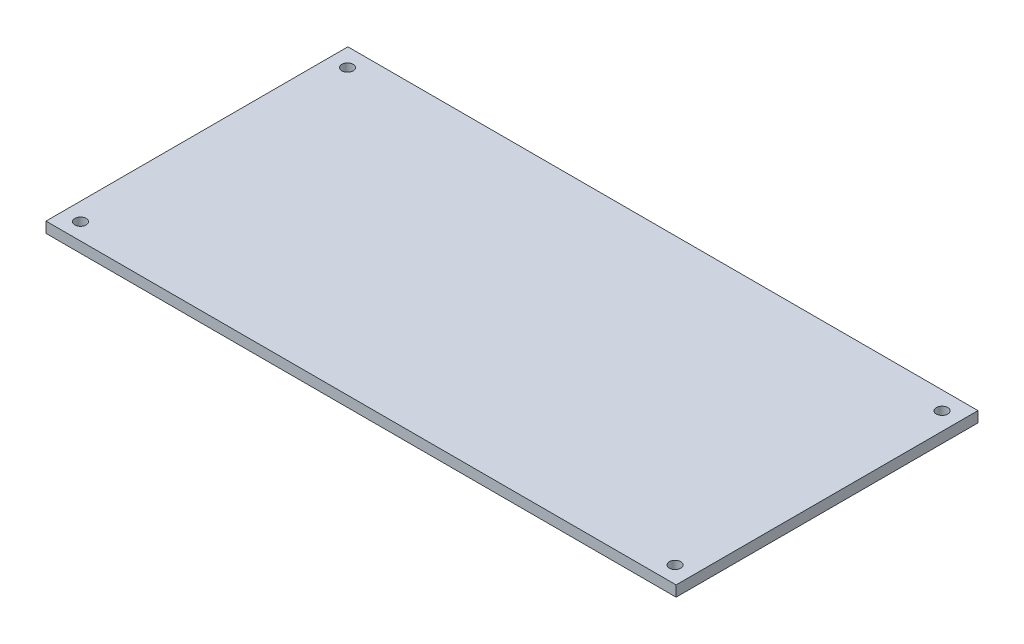
ISO-10303-21;
HEADER;
FILE_DESCRIPTION(('STEP AP214'),'2;1');
FILE_NAME('part.step','',(''),(''),'','','');
FILE_SCHEMA(('AUTOMOTIVE_DESIGN { 1 0 10303 214 1 1 1 1 }'));
ENDSEC;
DATA;
#1=APPLICATION_CONTEXT('core data for automotive mechanical design processes');
#2=APPLICATION_PROTOCOL_DEFINITION('international standard','automotive_design',2000,#1);
#3=PRODUCT_CONTEXT('',#1,'mechanical');
#4=PRODUCT('Part','Part','',(#3));
#5=PRODUCT_RELATED_PRODUCT_CATEGORY('part','',(#4));
#6=PRODUCT_DEFINITION_FORMATION('','',#4);
#7=PRODUCT_DEFINITION_CONTEXT('part definition',#1,'design');
#8=PRODUCT_DEFINITION('design','',#6,#7);
#9=PRODUCT_DEFINITION_SHAPE('','',#8);
#10=(LENGTH_UNIT() NAMED_UNIT(*) SI_UNIT(.MILLI.,.METRE.));
#11=(NAMED_UNIT(*) PLANE_ANGLE_UNIT() SI_UNIT($,.RADIAN.));
#12=(NAMED_UNIT(*) SI_UNIT($,.STERADIAN.) SOLID_ANGLE_UNIT());
#13=UNCERTAINTY_MEASURE_WITH_UNIT(LENGTH_MEASURE(1.E-05),#10,'distance_accuracy_value','');
#14=(GEOMETRIC_REPRESENTATION_CONTEXT(3) GLOBAL_UNCERTAINTY_ASSIGNED_CONTEXT((#13)) GLOBAL_UNIT_ASSIGNED_CONTEXT((#10,
#11,#12)) REPRESENTATION_CONTEXT('',''));
#15=CARTESIAN_POINT('',(0.,0.,0.));
#16=DIRECTION('',(0.,0.,1.));
#17=DIRECTION('',(1.,0.,0.));
#18=AXIS2_PLACEMENT_3D('',#15,#16,#17);
#19=CARTESIAN_POINT('',(88.5,3.,42.4));
#20=DIRECTION('',(-1.,0.,0.));
#21=DIRECTION('',(0.,0.,1.));
#22=AXIS2_PLACEMENT_3D('',#19,#20,#21);
#23=PLANE('',#22);
#24=DIRECTION('',(0.,0.,-1.));
#25=VECTOR('',#24,1.);
#26=CARTESIAN_POINT('',(88.5,0.,42.4));
#27=LINE('',#26,#25);
#28=CARTESIAN_POINT('',(88.5,0.,42.4));
#29=VERTEX_POINT('',#28);
#30=CARTESIAN_POINT('',(88.5,0.,-42.4));
#31=VERTEX_POINT('',#30);
#32=EDGE_CURVE('E104',#29,#31,#27,.T.);
#33=ORIENTED_EDGE('',*,*,#32,.T.);
#34=DIRECTION('',(0.,-1.,0.));
#35=VECTOR('',#34,1.);
#36=CARTESIAN_POINT('',(88.5,3.,-42.4));
#37=LINE('',#36,#35);
#38=CARTESIAN_POINT('',(88.5,3.,-42.4));
#39=VERTEX_POINT('',#38);
#40=EDGE_CURVE('E11',#39,#31,#37,.T.);
#41=ORIENTED_EDGE('',*,*,#40,.F.);
#42=DIRECTION('',(0.,0.,-1.));
#43=VECTOR('',#42,1.);
#44=CARTESIAN_POINT('',(88.5,3.,42.4));
#45=LINE('',#44,#43);
#46=CARTESIAN_POINT('',(88.5,3.,42.4));
#47=VERTEX_POINT('',#46);
#48=EDGE_CURVE('E92',#47,#39,#45,.T.);
#49=ORIENTED_EDGE('',*,*,#48,.F.);
#50=DIRECTION('',(0.,-1.,0.));
#51=VECTOR('',#50,1.);
#52=CARTESIAN_POINT('',(88.5,3.,42.4));
#53=LINE('',#52,#51);
#54=EDGE_CURVE('E100',#47,#29,#53,.T.);
#55=ORIENTED_EDGE('',*,*,#54,.T.);
#56=EDGE_LOOP('',(#33,#41,#49,#55));
#57=FACE_BOUND('',#56,.T.);
#58=ADVANCED_FACE('F41',(#57),#23,.F.);
#59=CARTESIAN_POINT('',(-88.5,3.,-42.4));
#60=DIRECTION('',(0.,0.,1.));
#61=DIRECTION('',(1.,0.,0.));
#62=AXIS2_PLACEMENT_3D('',#59,#60,#61);
#63=PLANE('',#62);
#64=DIRECTION('',(-1.,0.,0.));
#65=VECTOR('',#64,1.);
#66=CARTESIAN_POINT('',(-88.5,0.,-42.4));
#67=LINE('',#66,#65);
#68=CARTESIAN_POINT('',(-88.5,0.,-42.4));
#69=VERTEX_POINT('',#68);
#70=EDGE_CURVE('E96',#31,#69,#67,.T.);
#71=ORIENTED_EDGE('',*,*,#70,.T.);
#72=DIRECTION('',(0.,-1.,0.));
#73=VECTOR('',#72,1.);
#74=CARTESIAN_POINT('',(-88.5,3.,-42.4));
#75=LINE('',#74,#73);
#76=CARTESIAN_POINT('',(-88.5,3.,-42.4));
#77=VERTEX_POINT('',#76);
#78=EDGE_CURVE('E49',#77,#69,#75,.T.);
#79=ORIENTED_EDGE('',*,*,#78,.F.);
#80=DIRECTION('',(-1.,0.,0.));
#81=VECTOR('',#80,1.);
#82=CARTESIAN_POINT('',(-88.5,3.,-42.4));
#83=LINE('',#82,#81);
#84=EDGE_CURVE('E87',#39,#77,#83,.T.);
#85=ORIENTED_EDGE('',*,*,#84,.F.);
#86=ORIENTED_EDGE('',*,*,#40,.T.);
#87=EDGE_LOOP('',(#71,#79,#85,#86));
#88=FACE_BOUND('',#87,.T.);
#89=ADVANCED_FACE('F95',(#88),#63,.F.);
#90=CARTESIAN_POINT('',(-88.5,3.,42.4));
#91=DIRECTION('',(1.,0.,0.));
#92=DIRECTION('',(0.,0.,-1.));
#93=AXIS2_PLACEMENT_3D('',#90,#91,#92);
#94=PLANE('',#93);
#95=DIRECTION('',(0.,0.,1.));
#96=VECTOR('',#95,1.);
#97=CARTESIAN_POINT('',(-88.5,0.,42.4));
#98=LINE('',#97,#96);
#99=CARTESIAN_POINT('',(-88.5,0.,42.4));
#100=VERTEX_POINT('',#99);
#101=EDGE_CURVE('E74',#69,#100,#98,.T.);
#102=ORIENTED_EDGE('',*,*,#101,.T.);
#103=DIRECTION('',(0.,-1.,0.));
#104=VECTOR('',#103,1.);
#105=CARTESIAN_POINT('',(-88.5,3.,42.4));
#106=LINE('',#105,#104);
#107=CARTESIAN_POINT('',(-88.5,3.,42.4));
#108=VERTEX_POINT('',#107);
#109=EDGE_CURVE('E97',#108,#100,#106,.T.);
#110=ORIENTED_EDGE('',*,*,#109,.F.);
#111=DIRECTION('',(0.,0.,1.));
#112=VECTOR('',#111,1.);
#113=CARTESIAN_POINT('',(-88.5,3.,42.4));
#114=LINE('',#113,#112);
#115=EDGE_CURVE('E90',#77,#108,#114,.T.);
#116=ORIENTED_EDGE('',*,*,#115,.F.);
#117=ORIENTED_EDGE('',*,*,#78,.T.);
#118=EDGE_LOOP('',(#102,#110,#116,#117));
#119=FACE_BOUND('',#118,.T.);
#120=ADVANCED_FACE('F98',(#119),#94,.F.);
#121=CARTESIAN_POINT('',(-88.5,3.,42.4));
#122=DIRECTION('',(0.,0.,-1.));
#123=DIRECTION('',(-1.,0.,0.));
#124=AXIS2_PLACEMENT_3D('',#121,#122,#123);
#125=PLANE('',#124);
#126=DIRECTION('',(1.,0.,0.));
#127=VECTOR('',#126,1.);
#128=CARTESIAN_POINT('',(-88.5,0.,42.4));
#129=LINE('',#128,#127);
#130=EDGE_CURVE('E80',#100,#29,#129,.T.);
#131=ORIENTED_EDGE('',*,*,#130,.T.);
#132=ORIENTED_EDGE('',*,*,#54,.F.);
#133=DIRECTION('',(1.,0.,0.));
#134=VECTOR('',#133,1.);
#135=CARTESIAN_POINT('',(-88.5,3.,42.4));
#136=LINE('',#135,#134);
#137=EDGE_CURVE('E57',#108,#47,#136,.T.);
#138=ORIENTED_EDGE('',*,*,#137,.F.);
#139=ORIENTED_EDGE('',*,*,#109,.T.);
#140=EDGE_LOOP('',(#131,#132,#138,#139));
#141=FACE_BOUND('',#140,.T.);
#142=ADVANCED_FACE('F112',(#141),#125,.F.);
#143=CARTESIAN_POINT('',(0.,3.,0.));
#144=DIRECTION('',(0.,-1.,0.));
#145=DIRECTION('',(0.,0.,-1.));
#146=AXIS2_PLACEMENT_3D('',#143,#144,#145);
#147=PLANE('',#146);
#148=CARTESIAN_POINT('',(-83.5,3.,37.7));
#149=DIRECTION('',(0.,1.,0.));
#150=DIRECTION('',(0.,0.,1.));
#151=AXIS2_PLACEMENT_3D('',#148,#149,#150);
#152=CIRCLE('',#151,1.59999999999996);
#153=CARTESIAN_POINT('',(-83.5,3.,39.2999999999999));
#154=VERTEX_POINT('',#153);
#155=EDGE_CURVE('E124',#154,#154,#152,.T.);
#156=ORIENTED_EDGE('',*,*,#155,.F.);
#157=EDGE_LOOP('',(#156));
#158=FACE_BOUND('',#157,.T.);
#159=CARTESIAN_POINT('',(-83.5,3.,-37.3));
#160=DIRECTION('',(0.,1.,0.));
#161=DIRECTION('',(0.,0.,1.));
#162=AXIS2_PLACEMENT_3D('',#159,#160,#161);
#163=CIRCLE('',#162,1.59999999999993);
#164=CARTESIAN_POINT('',(-83.5,3.,-35.7000000000001));
#165=VERTEX_POINT('',#164);
#166=EDGE_CURVE('E130',#165,#165,#163,.T.);
#167=ORIENTED_EDGE('',*,*,#166,.F.);
#168=EDGE_LOOP('',(#167));
#169=FACE_BOUND('',#168,.T.);
#170=CARTESIAN_POINT('',(83.5,3.,-37.3));
#171=DIRECTION('',(0.,1.,0.));
#172=DIRECTION('',(0.,0.,1.));
#173=AXIS2_PLACEMENT_3D('',#170,#171,#172);
#174=CIRCLE('',#173,1.59999999999993);
#175=CARTESIAN_POINT('',(83.5,3.,-35.7000000000001));
#176=VERTEX_POINT('',#175);
#177=EDGE_CURVE('E136',#176,#176,#174,.T.);
#178=ORIENTED_EDGE('',*,*,#177,.F.);
#179=EDGE_LOOP('',(#178));
#180=FACE_BOUND('',#179,.T.);
#181=CARTESIAN_POINT('',(83.5,3.,37.7));
#182=DIRECTION('',(0.,1.,0.));
#183=DIRECTION('',(0.,0.,1.));
#184=AXIS2_PLACEMENT_3D('',#181,#182,#183);
#185=CIRCLE('',#184,1.59999999999996);
#186=CARTESIAN_POINT('',(83.5,3.,39.3));
#187=VERTEX_POINT('',#186);
#188=EDGE_CURVE('E118',#187,#187,#185,.T.);
#189=ORIENTED_EDGE('',*,*,#188,.F.);
#190=EDGE_LOOP('',(#189));
#191=FACE_BOUND('',#190,.T.);
#192=ORIENTED_EDGE('',*,*,#48,.T.);
#193=ORIENTED_EDGE('',*,*,#84,.T.);
#194=ORIENTED_EDGE('',*,*,#115,.T.);
#195=ORIENTED_EDGE('',*,*,#137,.T.);
#196=EDGE_LOOP('',(#192,#193,#194,#195));
#197=FACE_BOUND('',#196,.T.);
#198=ADVANCED_FACE('F88',(#158,#169,#180,#191,#197),#147,.F.);
#199=CARTESIAN_POINT('',(0.,0.,0.));
#200=DIRECTION('',(0.,-1.,0.));
#201=DIRECTION('',(0.,0.,-1.));
#202=AXIS2_PLACEMENT_3D('',#199,#200,#201);
#203=PLANE('',#202);
#204=CARTESIAN_POINT('',(-83.5,0.,37.7));
#205=DIRECTION('',(0.,1.,0.));
#206=DIRECTION('',(0.,0.,1.));
#207=AXIS2_PLACEMENT_3D('',#204,#205,#206);
#208=CIRCLE('',#207,1.59999999999996);
#209=CARTESIAN_POINT('',(-83.5,0.,39.2999999999999));
#210=VERTEX_POINT('',#209);
#211=EDGE_CURVE('E127',#210,#210,#208,.T.);
#212=ORIENTED_EDGE('',*,*,#211,.T.);
#213=EDGE_LOOP('',(#212));
#214=FACE_BOUND('',#213,.T.);
#215=CARTESIAN_POINT('',(-83.5,0.,-37.3));
#216=DIRECTION('',(0.,1.,0.));
#217=DIRECTION('',(0.,0.,1.));
#218=AXIS2_PLACEMENT_3D('',#215,#216,#217);
#219=CIRCLE('',#218,1.59999999999993);
#220=CARTESIAN_POINT('',(-83.5,0.,-35.7000000000001));
#221=VERTEX_POINT('',#220);
#222=EDGE_CURVE('E133',#221,#221,#219,.T.);
#223=ORIENTED_EDGE('',*,*,#222,.T.);
#224=EDGE_LOOP('',(#223));
#225=FACE_BOUND('',#224,.T.);
#226=CARTESIAN_POINT('',(83.5,0.,-37.3));
#227=DIRECTION('',(0.,1.,0.));
#228=DIRECTION('',(0.,0.,1.));
#229=AXIS2_PLACEMENT_3D('',#226,#227,#228);
#230=CIRCLE('',#229,1.59999999999993);
#231=CARTESIAN_POINT('',(83.5,0.,-35.7000000000001));
#232=VERTEX_POINT('',#231);
#233=EDGE_CURVE('E121',#232,#232,#230,.T.);
#234=ORIENTED_EDGE('',*,*,#233,.T.);
#235=EDGE_LOOP('',(#234));
#236=FACE_BOUND('',#235,.T.);
#237=CARTESIAN_POINT('',(83.5,0.,37.7));
#238=DIRECTION('',(0.,1.,0.));
#239=DIRECTION('',(0.,0.,1.));
#240=AXIS2_PLACEMENT_3D('',#237,#238,#239);
#241=CIRCLE('',#240,1.59999999999996);
#242=CARTESIAN_POINT('',(83.5,0.,39.3));
#243=VERTEX_POINT('',#242);
#244=EDGE_CURVE('E107',#243,#243,#241,.T.);
#245=ORIENTED_EDGE('',*,*,#244,.T.);
#246=EDGE_LOOP('',(#245));
#247=FACE_BOUND('',#246,.T.);
#248=ORIENTED_EDGE('',*,*,#32,.F.);
#249=ORIENTED_EDGE('',*,*,#130,.F.);
#250=ORIENTED_EDGE('',*,*,#101,.F.);
#251=ORIENTED_EDGE('',*,*,#70,.F.);
#252=EDGE_LOOP('',(#248,#249,#250,#251));
#253=FACE_BOUND('',#252,.T.);
#254=ADVANCED_FACE('F115',(#214,#225,#236,#247,#253),#203,.T.);
#255=CARTESIAN_POINT('',(83.5,0.,37.7));
#256=DIRECTION('',(0.,1.,0.));
#257=DIRECTION('',(0.,0.,1.));
#258=AXIS2_PLACEMENT_3D('',#255,#256,#257);
#259=CYLINDRICAL_SURFACE('',#258,1.59999999999996);
#260=ORIENTED_EDGE('',*,*,#244,.F.);
#261=EDGE_LOOP('',(#260));
#262=FACE_BOUND('',#261,.T.);
#263=ORIENTED_EDGE('',*,*,#188,.T.);
#264=EDGE_LOOP('',(#263));
#265=FACE_BOUND('',#264,.T.);
#266=ADVANCED_FACE('F148',(#262,#265),#259,.F.);
#267=CARTESIAN_POINT('',(83.5,0.,-37.3));
#268=DIRECTION('',(0.,1.,0.));
#269=DIRECTION('',(0.,0.,1.));
#270=AXIS2_PLACEMENT_3D('',#267,#268,#269);
#271=CYLINDRICAL_SURFACE('',#270,1.59999999999993);
#272=ORIENTED_EDGE('',*,*,#233,.F.);
#273=EDGE_LOOP('',(#272));
#274=FACE_BOUND('',#273,.T.);
#275=ORIENTED_EDGE('',*,*,#177,.T.);
#276=EDGE_LOOP('',(#275));
#277=FACE_BOUND('',#276,.T.);
#278=ADVANCED_FACE('F144',(#274,#277),#271,.F.);
#279=CARTESIAN_POINT('',(-83.5,0.,-37.3));
#280=DIRECTION('',(0.,1.,0.));
#281=DIRECTION('',(0.,0.,1.));
#282=AXIS2_PLACEMENT_3D('',#279,#280,#281);
#283=CYLINDRICAL_SURFACE('',#282,1.59999999999993);
#284=ORIENTED_EDGE('',*,*,#222,.F.);
#285=EDGE_LOOP('',(#284));
#286=FACE_BOUND('',#285,.T.);
#287=ORIENTED_EDGE('',*,*,#166,.T.);
#288=EDGE_LOOP('',(#287));
#289=FACE_BOUND('',#288,.T.);
#290=ADVANCED_FACE('F147',(#286,#289),#283,.F.);
#291=CARTESIAN_POINT('',(-83.5,0.,37.7));
#292=DIRECTION('',(0.,1.,0.));
#293=DIRECTION('',(0.,0.,1.));
#294=AXIS2_PLACEMENT_3D('',#291,#292,#293);
#295=CYLINDRICAL_SURFACE('',#294,1.59999999999996);
#296=ORIENTED_EDGE('',*,*,#211,.F.);
#297=EDGE_LOOP('',(#296));
#298=FACE_BOUND('',#297,.T.);
#299=ORIENTED_EDGE('',*,*,#155,.T.);
#300=EDGE_LOOP('',(#299));
#301=FACE_BOUND('',#300,.T.);
#302=ADVANCED_FACE('F211',(#298,#301),#295,.F.);
#303=CLOSED_SHELL('',(#58,#89,#120,#142,#198,#254,#266,#278,#290,#302));
#304=MANIFOLD_SOLID_BREP('B2',#303);
#305=ADVANCED_BREP_SHAPE_REPRESENTATION('',(#18,#304),#14);
#306=SHAPE_DEFINITION_REPRESENTATION(#9,#305);
ENDSEC;
END-ISO-10303-21;
